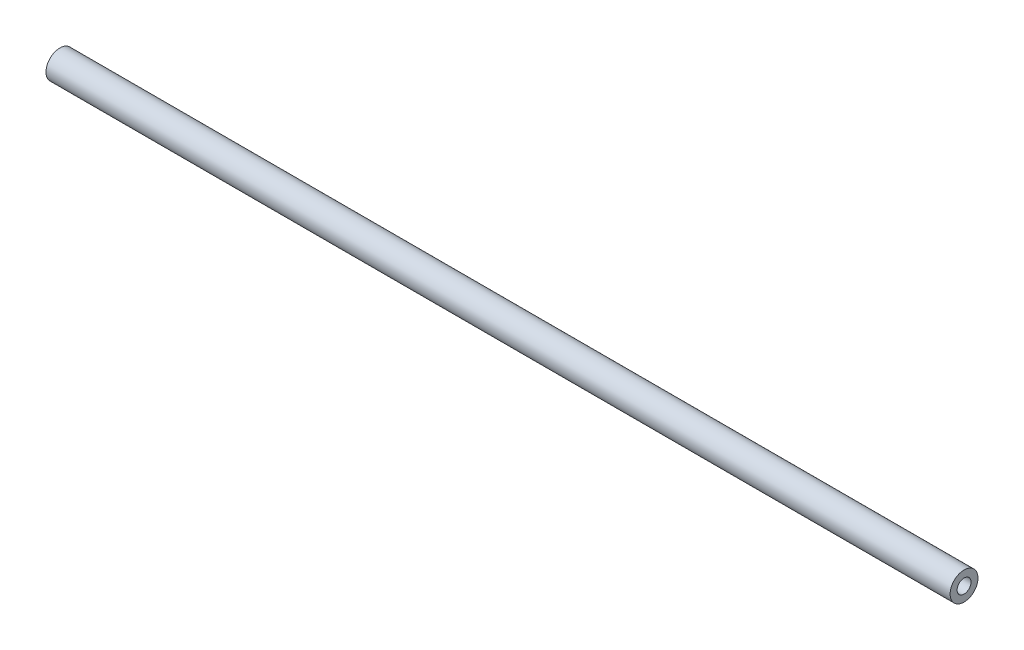
ISO-10303-21;
HEADER;
FILE_DESCRIPTION(('STEP AP214'),'2;1');
FILE_NAME('part.step','',(''),(''),'','','');
FILE_SCHEMA(('AUTOMOTIVE_DESIGN { 1 0 10303 214 1 1 1 1 }'));
ENDSEC;
DATA;
#1=APPLICATION_CONTEXT('core data for automotive mechanical design processes');
#2=APPLICATION_PROTOCOL_DEFINITION('international standard','automotive_design',2000,#1);
#3=PRODUCT_CONTEXT('',#1,'mechanical');
#4=PRODUCT('Part','Part','',(#3));
#5=PRODUCT_RELATED_PRODUCT_CATEGORY('part','',(#4));
#6=PRODUCT_DEFINITION_FORMATION('','',#4);
#7=PRODUCT_DEFINITION_CONTEXT('part definition',#1,'design');
#8=PRODUCT_DEFINITION('design','',#6,#7);
#9=PRODUCT_DEFINITION_SHAPE('','',#8);
#10=(LENGTH_UNIT() NAMED_UNIT(*) SI_UNIT(.MILLI.,.METRE.));
#11=(NAMED_UNIT(*) PLANE_ANGLE_UNIT() SI_UNIT($,.RADIAN.));
#12=(NAMED_UNIT(*) SI_UNIT($,.STERADIAN.) SOLID_ANGLE_UNIT());
#13=UNCERTAINTY_MEASURE_WITH_UNIT(LENGTH_MEASURE(1.E-05),#10,'distance_accuracy_value','');
#14=(GEOMETRIC_REPRESENTATION_CONTEXT(3) GLOBAL_UNCERTAINTY_ASSIGNED_CONTEXT((#13)) GLOBAL_UNIT_ASSIGNED_CONTEXT((#10,
#11,#12)) REPRESENTATION_CONTEXT('',''));
#15=CARTESIAN_POINT('',(0.,0.,0.));
#16=DIRECTION('',(0.,0.,1.));
#17=DIRECTION('',(1.,0.,0.));
#18=AXIS2_PLACEMENT_3D('',#15,#16,#17);
#19=CARTESIAN_POINT('',(247.539999999989,0.,0.));
#20=DIRECTION('',(1.,0.,0.));
#21=DIRECTION('',(0.,0.,-1.));
#22=AXIS2_PLACEMENT_3D('',#19,#20,#21);
#23=PLANE('',#22);
#24=CARTESIAN_POINT('',(247.539999999989,0.,0.));
#25=DIRECTION('',(1.,0.,0.));
#26=DIRECTION('',(0.,0.,-1.));
#27=AXIS2_PLACEMENT_3D('',#24,#25,#26);
#28=CIRCLE('',#27,4.);
#29=CARTESIAN_POINT('',(247.539999999989,0.,-4.));
#30=VERTEX_POINT('',#29);
#31=EDGE_CURVE('E10',#30,#30,#28,.T.);
#32=ORIENTED_EDGE('',*,*,#31,.T.);
#33=EDGE_LOOP('',(#32));
#34=FACE_BOUND('',#33,.T.);
#35=CARTESIAN_POINT('',(247.539999999989,0.,0.));
#36=DIRECTION('',(1.,0.,0.));
#37=DIRECTION('',(0.,0.,-1.));
#38=AXIS2_PLACEMENT_3D('',#35,#36,#37);
#39=CIRCLE('',#38,2.);
#40=CARTESIAN_POINT('',(247.539999999989,0.,-2.));
#41=VERTEX_POINT('',#40);
#42=EDGE_CURVE('E42',#41,#41,#39,.T.);
#43=ORIENTED_EDGE('',*,*,#42,.F.);
#44=EDGE_LOOP('',(#43));
#45=FACE_BOUND('',#44,.T.);
#46=ADVANCED_FACE('F34',(#34,#45),#23,.T.);
#47=CARTESIAN_POINT('',(247.539999999989,0.,0.));
#48=DIRECTION('',(-1.,0.,0.));
#49=DIRECTION('',(0.,0.,1.));
#50=AXIS2_PLACEMENT_3D('',#47,#48,#49);
#51=CYLINDRICAL_SURFACE('',#50,4.);
#52=ORIENTED_EDGE('',*,*,#31,.F.);
#53=EDGE_LOOP('',(#52));
#54=FACE_BOUND('',#53,.T.);
#55=CARTESIAN_POINT('',(-11.9999999999974,0.,0.));
#56=DIRECTION('',(1.,0.,0.));
#57=DIRECTION('',(0.,0.,-1.));
#58=AXIS2_PLACEMENT_3D('',#55,#56,#57);
#59=CIRCLE('',#58,4.);
#60=CARTESIAN_POINT('',(-11.9999999999974,0.,-4.));
#61=VERTEX_POINT('',#60);
#62=EDGE_CURVE('E48',#61,#61,#59,.T.);
#63=ORIENTED_EDGE('',*,*,#62,.T.);
#64=EDGE_LOOP('',(#63));
#65=FACE_BOUND('',#64,.T.);
#66=ADVANCED_FACE('F36',(#54,#65),#51,.T.);
#67=CARTESIAN_POINT('',(247.539999999989,0.,0.));
#68=DIRECTION('',(-1.,0.,0.));
#69=DIRECTION('',(0.,0.,1.));
#70=AXIS2_PLACEMENT_3D('',#67,#68,#69);
#71=CYLINDRICAL_SURFACE('',#70,2.);
#72=ORIENTED_EDGE('',*,*,#42,.T.);
#73=EDGE_LOOP('',(#72));
#74=FACE_BOUND('',#73,.T.);
#75=CARTESIAN_POINT('',(-11.9999999999974,0.,0.));
#76=DIRECTION('',(1.,0.,0.));
#77=DIRECTION('',(0.,0.,-1.));
#78=AXIS2_PLACEMENT_3D('',#75,#76,#77);
#79=CIRCLE('',#78,2.);
#80=CARTESIAN_POINT('',(-11.9999999999974,0.,-2.));
#81=VERTEX_POINT('',#80);
#82=EDGE_CURVE('E53',#81,#81,#79,.T.);
#83=ORIENTED_EDGE('',*,*,#82,.F.);
#84=EDGE_LOOP('',(#83));
#85=FACE_BOUND('',#84,.T.);
#86=ADVANCED_FACE('F62',(#74,#85),#71,.F.);
#87=CARTESIAN_POINT('',(-11.9999999999974,0.,0.));
#88=DIRECTION('',(1.,0.,0.));
#89=DIRECTION('',(0.,0.,-1.));
#90=AXIS2_PLACEMENT_3D('',#87,#88,#89);
#91=PLANE('',#90);
#92=ORIENTED_EDGE('',*,*,#82,.T.);
#93=EDGE_LOOP('',(#92));
#94=FACE_BOUND('',#93,.T.);
#95=ORIENTED_EDGE('',*,*,#62,.F.);
#96=EDGE_LOOP('',(#95));
#97=FACE_BOUND('',#96,.T.);
#98=ADVANCED_FACE('F59',(#94,#97),#91,.F.);
#99=CLOSED_SHELL('',(#46,#66,#86,#98));
#100=MANIFOLD_SOLID_BREP('B2',#99);
#101=ADVANCED_BREP_SHAPE_REPRESENTATION('',(#18,#100),#14);
#102=SHAPE_DEFINITION_REPRESENTATION(#9,#101);
ENDSEC;
END-ISO-10303-21;
